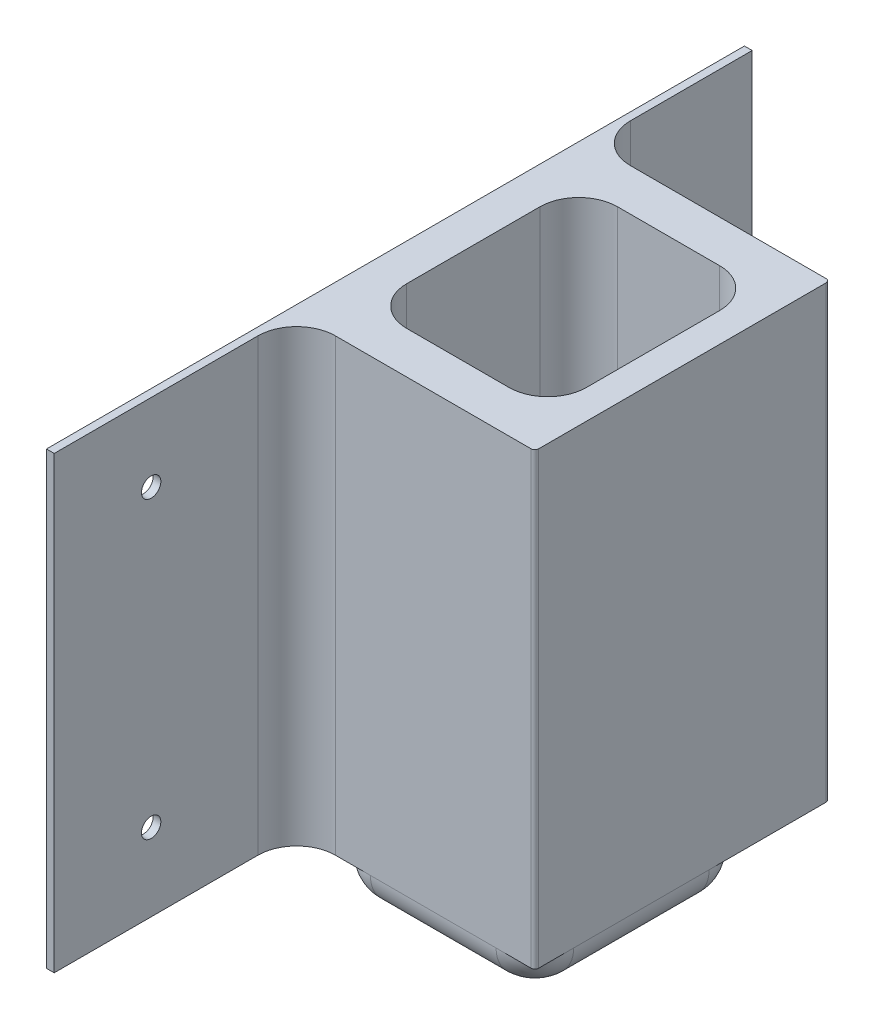
ISO-10303-21;
HEADER;
FILE_DESCRIPTION(('STEP AP214'),'2;1');
FILE_NAME('part.step','',(''),(''),'','','');
FILE_SCHEMA(('AUTOMOTIVE_DESIGN { 1 0 10303 214 1 1 1 1 }'));
ENDSEC;
DATA;
#1=APPLICATION_CONTEXT('core data for automotive mechanical design processes');
#2=APPLICATION_PROTOCOL_DEFINITION('international standard','automotive_design',2000,#1);
#3=PRODUCT_CONTEXT('',#1,'mechanical');
#4=PRODUCT('Part','Part','',(#3));
#5=PRODUCT_RELATED_PRODUCT_CATEGORY('part','',(#4));
#6=PRODUCT_DEFINITION_FORMATION('','',#4);
#7=PRODUCT_DEFINITION_CONTEXT('part definition',#1,'design');
#8=PRODUCT_DEFINITION('design','',#6,#7);
#9=PRODUCT_DEFINITION_SHAPE('','',#8);
#10=(LENGTH_UNIT() NAMED_UNIT(*) SI_UNIT(.MILLI.,.METRE.));
#11=(NAMED_UNIT(*) PLANE_ANGLE_UNIT() SI_UNIT($,.RADIAN.));
#12=(NAMED_UNIT(*) SI_UNIT($,.STERADIAN.) SOLID_ANGLE_UNIT());
#13=UNCERTAINTY_MEASURE_WITH_UNIT(LENGTH_MEASURE(1.E-05),#10,'distance_accuracy_value','');
#14=(GEOMETRIC_REPRESENTATION_CONTEXT(3) GLOBAL_UNCERTAINTY_ASSIGNED_CONTEXT((#13)) GLOBAL_UNIT_ASSIGNED_CONTEXT((#10,
#11,#12)) REPRESENTATION_CONTEXT('',''));
#15=CARTESIAN_POINT('',(0.,0.,0.));
#16=DIRECTION('',(0.,0.,1.));
#17=DIRECTION('',(1.,0.,0.));
#18=AXIS2_PLACEMENT_3D('',#15,#16,#17);
#19=CARTESIAN_POINT('',(2.,0.,0.));
#20=DIRECTION('',(-1.,0.,0.));
#21=DIRECTION('',(0.,0.,1.));
#22=AXIS2_PLACEMENT_3D('',#19,#20,#21);
#23=PLANE('',#22);
#24=CARTESIAN_POINT('',(2.,-38.,65.));
#25=DIRECTION('',(1.,0.,0.));
#26=DIRECTION('',(0.,0.,-1.));
#27=AXIS2_PLACEMENT_3D('',#24,#25,#26);
#28=CIRCLE('',#27,2.5);
#29=CARTESIAN_POINT('',(2.,-38.,62.5));
#30=VERTEX_POINT('',#29);
#31=EDGE_CURVE('E906',#30,#30,#28,.T.);
#32=ORIENTED_EDGE('',*,*,#31,.F.);
#33=EDGE_LOOP('',(#32));
#34=FACE_BOUND('',#33,.T.);
#35=DIRECTION('',(0.,0.,-1.));
#36=VECTOR('',#35,1.);
#37=CARTESIAN_POINT('',(2.,-58.,90.));
#38=LINE('',#37,#36);
#39=CARTESIAN_POINT('',(2.,-58.,90.));
#40=VERTEX_POINT('',#39);
#41=CARTESIAN_POINT('',(2.,-58.,37.470907931375));
#42=VERTEX_POINT('',#41);
#43=EDGE_CURVE('E390',#40,#42,#38,.T.);
#44=ORIENTED_EDGE('',*,*,#43,.T.);
#45=DIRECTION('',(0.,1.,0.));
#46=VECTOR('',#45,1.);
#47=CARTESIAN_POINT('',(2.,0.,37.4709079313749));
#48=LINE('',#47,#46);
#49=CARTESIAN_POINT('',(2.,58.,37.470907931375));
#50=VERTEX_POINT('',#49);
#51=EDGE_CURVE('E412',#42,#50,#48,.T.);
#52=ORIENTED_EDGE('',*,*,#51,.T.);
#53=DIRECTION('',(0.,0.,1.));
#54=VECTOR('',#53,1.);
#55=CARTESIAN_POINT('',(2.,58.,90.));
#56=LINE('',#55,#54);
#57=CARTESIAN_POINT('',(2.,58.,90.));
#58=VERTEX_POINT('',#57);
#59=EDGE_CURVE('E382',#50,#58,#56,.T.);
#60=ORIENTED_EDGE('',*,*,#59,.T.);
#61=DIRECTION('',(0.,-1.,0.));
#62=VECTOR('',#61,1.);
#63=CARTESIAN_POINT('',(2.,-58.,90.));
#64=LINE('',#63,#62);
#65=EDGE_CURVE('E387',#58,#40,#64,.T.);
#66=ORIENTED_EDGE('',*,*,#65,.T.);
#67=EDGE_LOOP('',(#44,#52,#60,#66));
#68=FACE_BOUND('',#67,.T.);
#69=CARTESIAN_POINT('',(2.,38.,65.));
#70=DIRECTION('',(1.,0.,0.));
#71=DIRECTION('',(0.,0.,-1.));
#72=AXIS2_PLACEMENT_3D('',#69,#70,#71);
#73=CIRCLE('',#72,2.5);
#74=CARTESIAN_POINT('',(2.,38.,62.5));
#75=VERTEX_POINT('',#74);
#76=EDGE_CURVE('E902',#75,#75,#73,.T.);
#77=ORIENTED_EDGE('',*,*,#76,.F.);
#78=EDGE_LOOP('',(#77));
#79=FACE_BOUND('',#78,.T.);
#80=ADVANCED_FACE('F39',(#34,#68,#79),#23,.F.);
#81=CARTESIAN_POINT('',(2.,-38.,-65.));
#82=DIRECTION('',(1.,0.,0.));
#83=DIRECTION('',(0.,0.,-1.));
#84=AXIS2_PLACEMENT_3D('',#81,#82,#83);
#85=CIRCLE('',#84,2.5);
#86=CARTESIAN_POINT('',(2.,-38.,-67.5));
#87=VERTEX_POINT('',#86);
#88=EDGE_CURVE('E915',#87,#87,#85,.T.);
#89=ORIENTED_EDGE('',*,*,#88,.F.);
#90=EDGE_LOOP('',(#89));
#91=FACE_BOUND('',#90,.T.);
#92=CARTESIAN_POINT('',(2.,58.,-90.));
#93=VERTEX_POINT('',#92);
#94=CARTESIAN_POINT('',(2.,58.,-58.586349214035));
#95=VERTEX_POINT('',#94);
#96=EDGE_CURVE('E384',#93,#95,#56,.T.);
#97=ORIENTED_EDGE('',*,*,#96,.T.);
#98=DIRECTION('',(0.,1.,0.));
#99=VECTOR('',#98,1.);
#100=CARTESIAN_POINT('',(2.,-58.,-58.5863492140351));
#101=LINE('',#100,#99);
#102=CARTESIAN_POINT('',(2.,-58.,-58.586349214035));
#103=VERTEX_POINT('',#102);
#104=EDGE_CURVE('E420',#95,#103,#101,.F.);
#105=ORIENTED_EDGE('',*,*,#104,.T.);
#106=CARTESIAN_POINT('',(2.,-58.,-90.));
#107=VERTEX_POINT('',#106);
#108=EDGE_CURVE('E389',#103,#107,#38,.T.);
#109=ORIENTED_EDGE('',*,*,#108,.T.);
#110=DIRECTION('',(0.,1.,0.));
#111=VECTOR('',#110,1.);
#112=CARTESIAN_POINT('',(2.,-58.,-90.));
#113=LINE('',#112,#111);
#114=EDGE_CURVE('E379',#107,#93,#113,.T.);
#115=ORIENTED_EDGE('',*,*,#114,.T.);
#116=EDGE_LOOP('',(#97,#105,#109,#115));
#117=FACE_BOUND('',#116,.T.);
#118=CARTESIAN_POINT('',(2.,38.,-65.));
#119=DIRECTION('',(1.,0.,0.));
#120=DIRECTION('',(0.,0.,-1.));
#121=AXIS2_PLACEMENT_3D('',#118,#119,#120);
#122=CIRCLE('',#121,2.5);
#123=CARTESIAN_POINT('',(2.,38.,-67.5));
#124=VERTEX_POINT('',#123);
#125=EDGE_CURVE('E921',#124,#124,#122,.T.);
#126=ORIENTED_EDGE('',*,*,#125,.F.);
#127=EDGE_LOOP('',(#126));
#128=FACE_BOUND('',#127,.T.);
#129=ADVANCED_FACE('F541',(#91,#117,#128),#23,.F.);
#130=CARTESIAN_POINT('',(2.,-58.,90.));
#131=DIRECTION('',(0.,1.,0.));
#132=DIRECTION('',(0.,0.,1.));
#133=AXIS2_PLACEMENT_3D('',#130,#131,#132);
#134=PLANE('',#133);
#135=CARTESIAN_POINT('',(53.4290934014321,-58.,-17.4709079313749));
#136=DIRECTION('',(0.,-1.,0.));
#137=DIRECTION('',(0.,0.,-1.));
#138=AXIS2_PLACEMENT_3D('',#135,#136,#137);
#139=CIRCLE('',#138,10.);
#140=CARTESIAN_POINT('',(55.894546700716,-58.,-27.1622205374696));
#141=VERTEX_POINT('',#140);
#142=CARTESIAN_POINT('',(63.4290934014321,-58.,-17.4709079313749));
#143=VERTEX_POINT('',#142);
#144=EDGE_CURVE('E273',#141,#143,#139,.T.);
#145=ORIENTED_EDGE('',*,*,#144,.F.);
#146=DIRECTION('',(0.,0.,1.));
#147=VECTOR('',#146,1.);
#148=CARTESIAN_POINT('',(55.894546700716,-58.,0.));
#149=LINE('',#148,#147);
#150=CARTESIAN_POINT('',(55.894546700716,-58.,-27.7377206413301));
#151=VERTEX_POINT('',#150);
#152=EDGE_CURVE('E341',#151,#141,#149,.T.);
#153=ORIENTED_EDGE('',*,*,#152,.F.);
#154=CARTESIAN_POINT('',(45.894546700716,-58.,-27.7377206413301));
#155=DIRECTION('',(0.,1.,0.));
#156=DIRECTION('',(0.,0.,1.));
#157=AXIS2_PLACEMENT_3D('',#154,#155,#156);
#158=CIRCLE('',#157,9.99999999999999);
#159=CARTESIAN_POINT('',(45.894546700716,-58.,-37.7377206413301));
#160=VERTEX_POINT('',#159);
#161=EDGE_CURVE('E372',#151,#160,#158,.T.);
#162=ORIENTED_EDGE('',*,*,#161,.T.);
#163=DIRECTION('',(-1.,0.,0.));
#164=VECTOR('',#163,1.);
#165=CARTESIAN_POINT('',(0.,-58.,-37.7377206413301));
#166=LINE('',#165,#164);
#167=CARTESIAN_POINT('',(19.5345467007161,-58.,-37.7377206413301));
#168=VERTEX_POINT('',#167);
#169=EDGE_CURVE('E328',#160,#168,#166,.T.);
#170=ORIENTED_EDGE('',*,*,#169,.T.);
#171=CARTESIAN_POINT('',(19.5345467007161,-58.,-27.7377206413301));
#172=DIRECTION('',(0.,1.,0.));
#173=DIRECTION('',(0.,0.,1.));
#174=AXIS2_PLACEMENT_3D('',#171,#172,#173);
#175=CIRCLE('',#174,10.);
#176=CARTESIAN_POINT('',(9.53454670071606,-58.,-27.7377206413301));
#177=VERTEX_POINT('',#176);
#178=EDGE_CURVE('E325',#168,#177,#175,.T.);
#179=ORIENTED_EDGE('',*,*,#178,.T.);
#180=DIRECTION('',(0.,0.,1.));
#181=VECTOR('',#180,1.);
#182=CARTESIAN_POINT('',(9.53454670071606,-58.,0.));
#183=LINE('',#182,#181);
#184=CARTESIAN_POINT('',(9.53454670071606,-58.,6.62227935866991));
#185=VERTEX_POINT('',#184);
#186=EDGE_CURVE('E348',#177,#185,#183,.T.);
#187=ORIENTED_EDGE('',*,*,#186,.T.);
#188=CARTESIAN_POINT('',(19.5345467007161,-58.,6.62227935866991));
#189=DIRECTION('',(0.,1.,0.));
#190=DIRECTION('',(0.,0.,1.));
#191=AXIS2_PLACEMENT_3D('',#188,#189,#190);
#192=CIRCLE('',#191,10.);
#193=CARTESIAN_POINT('',(11.0229000270385,-58.,11.8712669660541));
#194=VERTEX_POINT('',#193);
#195=EDGE_CURVE('E369',#185,#194,#192,.T.);
#196=ORIENTED_EDGE('',*,*,#195,.T.);
#197=DIRECTION('',(0.,0.,-1.));
#198=VECTOR('',#197,1.);
#199=CARTESIAN_POINT('',(11.0229000270385,-58.,-17.4709079313749));
#200=LINE('',#199,#198);
#201=CARTESIAN_POINT('',(11.0229000270385,-58.,17.4709079313749));
#202=VERTEX_POINT('',#201);
#203=EDGE_CURVE('E276',#202,#194,#200,.T.);
#204=ORIENTED_EDGE('',*,*,#203,.F.);
#205=CARTESIAN_POINT('',(21.0229000270385,-58.,17.4709079313749));
#206=DIRECTION('',(0.,-1.,0.));
#207=DIRECTION('',(0.,0.,1.));
#208=AXIS2_PLACEMENT_3D('',#205,#206,#207);
#209=CIRCLE('',#208,10.);
#210=CARTESIAN_POINT('',(21.0229000270385,-58.,27.4709079313749));
#211=VERTEX_POINT('',#210);
#212=EDGE_CURVE('E266',#211,#202,#209,.T.);
#213=ORIENTED_EDGE('',*,*,#212,.F.);
#214=DIRECTION('',(-1.,0.,0.));
#215=VECTOR('',#214,1.);
#216=CARTESIAN_POINT('',(0.,-58.,27.4709079313749));
#217=LINE('',#216,#215);
#218=CARTESIAN_POINT('',(12.,-58.,27.4709079313749));
#219=VERTEX_POINT('',#218);
#220=EDGE_CURVE('E236',#211,#219,#217,.T.);
#221=ORIENTED_EDGE('',*,*,#220,.T.);
#222=CARTESIAN_POINT('',(12.,-58.,37.4709079313749));
#223=DIRECTION('',(0.,1.,0.));
#224=DIRECTION('',(0.,0.,1.));
#225=AXIS2_PLACEMENT_3D('',#222,#223,#224);
#226=CIRCLE('',#225,10.);
#227=EDGE_CURVE('E424',#219,#42,#226,.T.);
#228=ORIENTED_EDGE('',*,*,#227,.T.);
#229=ORIENTED_EDGE('',*,*,#43,.F.);
#230=DIRECTION('',(-1.,0.,0.));
#231=VECTOR('',#230,1.);
#232=CARTESIAN_POINT('',(2.,-58.,90.));
#233=LINE('',#232,#231);
#234=CARTESIAN_POINT('',(0.,-58.,90.));
#235=VERTEX_POINT('',#234);
#236=EDGE_CURVE('E403',#40,#235,#233,.T.);
#237=ORIENTED_EDGE('',*,*,#236,.T.);
#238=DIRECTION('',(0.,0.,-1.));
#239=VECTOR('',#238,1.);
#240=CARTESIAN_POINT('',(0.,-58.,90.));
#241=LINE('',#240,#239);
#242=CARTESIAN_POINT('',(0.,-58.,-90.));
#243=VERTEX_POINT('',#242);
#244=EDGE_CURVE('E383',#235,#243,#241,.T.);
#245=ORIENTED_EDGE('',*,*,#244,.T.);
#246=DIRECTION('',(-1.,0.,0.));
#247=VECTOR('',#246,1.);
#248=CARTESIAN_POINT('',(2.,-58.,-90.));
#249=LINE('',#248,#247);
#250=EDGE_CURVE('E393',#107,#243,#249,.T.);
#251=ORIENTED_EDGE('',*,*,#250,.F.);
#252=ORIENTED_EDGE('',*,*,#108,.F.);
#253=CARTESIAN_POINT('',(12.,-58.,-58.5863492140351));
#254=DIRECTION('',(0.,1.,0.));
#255=DIRECTION('',(0.,0.,1.));
#256=AXIS2_PLACEMENT_3D('',#253,#254,#255);
#257=CIRCLE('',#256,10.);
#258=CARTESIAN_POINT('',(12.,-58.,-48.5863492140351));
#259=VERTEX_POINT('',#258);
#260=EDGE_CURVE('E428',#103,#259,#257,.T.);
#261=ORIENTED_EDGE('',*,*,#260,.T.);
#262=DIRECTION('',(-1.,0.,0.));
#263=VECTOR('',#262,1.);
#264=CARTESIAN_POINT('',(0.,-58.,-48.5863492140351));
#265=LINE('',#264,#263);
#266=CARTESIAN_POINT('',(62.4519934284706,-58.,-48.5863492140351));
#267=VERTEX_POINT('',#266);
#268=EDGE_CURVE('E349',#267,#259,#265,.T.);
#269=ORIENTED_EDGE('',*,*,#268,.F.);
#270=CARTESIAN_POINT('',(62.4519934284706,-58.,-47.6092492410736));
#271=DIRECTION('',(0.,1.,0.));
#272=DIRECTION('',(0.,0.,1.));
#273=AXIS2_PLACEMENT_3D('',#270,#271,#272);
#274=CIRCLE('',#273,0.977099972961519);
#275=CARTESIAN_POINT('',(63.4290934014321,-58.,-47.6092492410736));
#276=VERTEX_POINT('',#275);
#277=EDGE_CURVE('E345',#276,#267,#274,.T.);
#278=ORIENTED_EDGE('',*,*,#277,.F.);
#279=DIRECTION('',(0.,0.,1.));
#280=VECTOR('',#279,1.);
#281=CARTESIAN_POINT('',(63.4290934014321,-58.,0.));
#282=LINE('',#281,#280);
#283=EDGE_CURVE('E361',#276,#143,#282,.T.);
#284=ORIENTED_EDGE('',*,*,#283,.T.);
#285=EDGE_LOOP('',(#145,#153,#162,#170,#179,#187,#196,#204,#213,#221,#228,#229,#237,#245,#251,
#252,#261,#269,#278,#284));
#286=FACE_BOUND('',#285,.T.);
#287=ADVANCED_FACE('F466',(#286),#134,.F.);
#288=CARTESIAN_POINT('',(2.,-58.,-90.));
#289=DIRECTION('',(0.,0.,1.));
#290=DIRECTION('',(1.,0.,0.));
#291=AXIS2_PLACEMENT_3D('',#288,#289,#290);
#292=PLANE('',#291);
#293=DIRECTION('',(0.,1.,0.));
#294=VECTOR('',#293,1.);
#295=CARTESIAN_POINT('',(0.,-58.,-90.));
#296=LINE('',#295,#294);
#297=CARTESIAN_POINT('',(0.,58.,-90.));
#298=VERTEX_POINT('',#297);
#299=EDGE_CURVE('E249',#243,#298,#296,.T.);
#300=ORIENTED_EDGE('',*,*,#299,.T.);
#301=DIRECTION('',(-1.,0.,0.));
#302=VECTOR('',#301,1.);
#303=CARTESIAN_POINT('',(2.,58.,-90.));
#304=LINE('',#303,#302);
#305=EDGE_CURVE('E409',#93,#298,#304,.T.);
#306=ORIENTED_EDGE('',*,*,#305,.F.);
#307=ORIENTED_EDGE('',*,*,#114,.F.);
#308=ORIENTED_EDGE('',*,*,#250,.T.);
#309=EDGE_LOOP('',(#300,#306,#307,#308));
#310=FACE_BOUND('',#309,.T.);
#311=ADVANCED_FACE('F565',(#310),#292,.F.);
#312=CARTESIAN_POINT('',(2.,58.,90.));
#313=DIRECTION('',(0.,-1.,0.));
#314=DIRECTION('',(0.,0.,-1.));
#315=AXIS2_PLACEMENT_3D('',#312,#313,#314);
#316=PLANE('',#315);
#317=DIRECTION('',(0.,0.,1.));
#318=VECTOR('',#317,1.);
#319=CARTESIAN_POINT('',(0.,58.,90.));
#320=LINE('',#319,#318);
#321=CARTESIAN_POINT('',(0.,58.,90.));
#322=VERTEX_POINT('',#321);
#323=EDGE_CURVE('E396',#298,#322,#320,.T.);
#324=ORIENTED_EDGE('',*,*,#323,.T.);
#325=DIRECTION('',(-1.,0.,0.));
#326=VECTOR('',#325,1.);
#327=CARTESIAN_POINT('',(2.,58.,90.));
#328=LINE('',#327,#326);
#329=EDGE_CURVE('E406',#58,#322,#328,.T.);
#330=ORIENTED_EDGE('',*,*,#329,.F.);
#331=ORIENTED_EDGE('',*,*,#59,.F.);
#332=CARTESIAN_POINT('',(12.,58.,37.4709079313749));
#333=DIRECTION('',(0.,-1.,0.));
#334=DIRECTION('',(0.,0.,-1.));
#335=AXIS2_PLACEMENT_3D('',#332,#333,#334);
#336=CIRCLE('',#335,10.);
#337=CARTESIAN_POINT('',(12.,58.,27.4709079313749));
#338=VERTEX_POINT('',#337);
#339=EDGE_CURVE('E422',#50,#338,#336,.T.);
#340=ORIENTED_EDGE('',*,*,#339,.T.);
#341=DIRECTION('',(-1.,0.,0.));
#342=VECTOR('',#341,1.);
#343=CARTESIAN_POINT('',(0.,58.,27.4709079313749));
#344=LINE('',#343,#342);
#345=CARTESIAN_POINT('',(62.4519934284706,58.,27.4709079313749));
#346=VERTEX_POINT('',#345);
#347=EDGE_CURVE('E313',#346,#338,#344,.T.);
#348=ORIENTED_EDGE('',*,*,#347,.F.);
#349=CARTESIAN_POINT('',(62.4519934284706,58.,26.4938079584134));
#350=DIRECTION('',(0.,-1.,0.));
#351=DIRECTION('',(0.,0.,-1.));
#352=AXIS2_PLACEMENT_3D('',#349,#350,#351);
#353=CIRCLE('',#352,0.977099972961512);
#354=CARTESIAN_POINT('',(63.4290934014321,58.,26.4938079584134));
#355=VERTEX_POINT('',#354);
#356=EDGE_CURVE('E308',#355,#346,#353,.T.);
#357=ORIENTED_EDGE('',*,*,#356,.F.);
#358=DIRECTION('',(0.,0.,1.));
#359=VECTOR('',#358,1.);
#360=CARTESIAN_POINT('',(63.4290934014321,58.,0.));
#361=LINE('',#360,#359);
#362=CARTESIAN_POINT('',(63.4290934014321,58.,-47.6092492410736));
#363=VERTEX_POINT('',#362);
#364=EDGE_CURVE('E290',#363,#355,#361,.T.);
#365=ORIENTED_EDGE('',*,*,#364,.F.);
#366=CARTESIAN_POINT('',(62.4519934284706,58.,-47.6092492410736));
#367=DIRECTION('',(0.,-1.,0.));
#368=DIRECTION('',(0.,0.,-1.));
#369=AXIS2_PLACEMENT_3D('',#366,#367,#368);
#370=CIRCLE('',#369,0.977099972961519);
#371=CARTESIAN_POINT('',(62.4519934284706,58.,-48.5863492140351));
#372=VERTEX_POINT('',#371);
#373=EDGE_CURVE('E319',#363,#372,#370,.F.);
#374=ORIENTED_EDGE('',*,*,#373,.T.);
#375=DIRECTION('',(-1.,0.,0.));
#376=VECTOR('',#375,1.);
#377=CARTESIAN_POINT('',(0.,58.,-48.5863492140351));
#378=LINE('',#377,#376);
#379=CARTESIAN_POINT('',(12.,58.,-48.5863492140351));
#380=VERTEX_POINT('',#379);
#381=EDGE_CURVE('E316',#372,#380,#378,.T.);
#382=ORIENTED_EDGE('',*,*,#381,.T.);
#383=CARTESIAN_POINT('',(12.,58.,-58.5863492140351));
#384=DIRECTION('',(0.,-1.,0.));
#385=DIRECTION('',(0.,0.,-1.));
#386=AXIS2_PLACEMENT_3D('',#383,#384,#385);
#387=CIRCLE('',#386,10.);
#388=EDGE_CURVE('E426',#380,#95,#387,.T.);
#389=ORIENTED_EDGE('',*,*,#388,.T.);
#390=ORIENTED_EDGE('',*,*,#96,.F.);
#391=ORIENTED_EDGE('',*,*,#305,.T.);
#392=EDGE_LOOP('',(#324,#330,#331,#340,#348,#357,#365,#374,#382,#389,#390,#391));
#393=FACE_BOUND('',#392,.T.);
#394=CARTESIAN_POINT('',(19.5345467007161,58.,-27.7377206413301));
#395=DIRECTION('',(0.,-1.,0.));
#396=DIRECTION('',(0.,0.,-1.));
#397=AXIS2_PLACEMENT_3D('',#394,#395,#396);
#398=CIRCLE('',#397,10.);
#399=CARTESIAN_POINT('',(19.5345467007161,58.,-37.7377206413301));
#400=VERTEX_POINT('',#399);
#401=CARTESIAN_POINT('',(9.53454670071606,58.,-27.7377206413301));
#402=VERTEX_POINT('',#401);
#403=EDGE_CURVE('E302',#400,#402,#398,.F.);
#404=ORIENTED_EDGE('',*,*,#403,.F.);
#405=DIRECTION('',(-1.,0.,0.));
#406=VECTOR('',#405,1.);
#407=CARTESIAN_POINT('',(0.,58.,-37.7377206413301));
#408=LINE('',#407,#406);
#409=CARTESIAN_POINT('',(45.894546700716,58.,-37.7377206413301));
#410=VERTEX_POINT('',#409);
#411=EDGE_CURVE('E299',#410,#400,#408,.T.);
#412=ORIENTED_EDGE('',*,*,#411,.F.);
#413=CARTESIAN_POINT('',(45.894546700716,58.,-27.7377206413301));
#414=DIRECTION('',(0.,-1.,0.));
#415=DIRECTION('',(0.,0.,-1.));
#416=AXIS2_PLACEMENT_3D('',#413,#414,#415);
#417=CIRCLE('',#416,9.99999999999999);
#418=CARTESIAN_POINT('',(55.894546700716,58.,-27.7377206413301));
#419=VERTEX_POINT('',#418);
#420=EDGE_CURVE('E296',#419,#410,#417,.F.);
#421=ORIENTED_EDGE('',*,*,#420,.F.);
#422=DIRECTION('',(0.,0.,1.));
#423=VECTOR('',#422,1.);
#424=CARTESIAN_POINT('',(55.894546700716,58.,0.));
#425=LINE('',#424,#423);
#426=CARTESIAN_POINT('',(55.894546700716,58.,6.62227935866991));
#427=VERTEX_POINT('',#426);
#428=EDGE_CURVE('E293',#419,#427,#425,.T.);
#429=ORIENTED_EDGE('',*,*,#428,.T.);
#430=CARTESIAN_POINT('',(45.894546700716,58.,6.62227935866991));
#431=DIRECTION('',(0.,-1.,0.));
#432=DIRECTION('',(0.,0.,-1.));
#433=AXIS2_PLACEMENT_3D('',#430,#431,#432);
#434=CIRCLE('',#433,10.);
#435=CARTESIAN_POINT('',(45.894546700716,58.,16.6222793586699));
#436=VERTEX_POINT('',#435);
#437=EDGE_CURVE('E289',#427,#436,#434,.T.);
#438=ORIENTED_EDGE('',*,*,#437,.T.);
#439=DIRECTION('',(-1.,0.,0.));
#440=VECTOR('',#439,1.);
#441=CARTESIAN_POINT('',(0.,58.,16.6222793586699));
#442=LINE('',#441,#440);
#443=CARTESIAN_POINT('',(19.5345467007161,58.,16.6222793586699));
#444=VERTEX_POINT('',#443);
#445=EDGE_CURVE('E286',#436,#444,#442,.T.);
#446=ORIENTED_EDGE('',*,*,#445,.T.);
#447=CARTESIAN_POINT('',(19.5345467007161,58.,6.62227935866991));
#448=DIRECTION('',(0.,-1.,0.));
#449=DIRECTION('',(0.,0.,-1.));
#450=AXIS2_PLACEMENT_3D('',#447,#448,#449);
#451=CIRCLE('',#450,10.);
#452=CARTESIAN_POINT('',(9.53454670071606,58.,6.62227935866991));
#453=VERTEX_POINT('',#452);
#454=EDGE_CURVE('E285',#453,#444,#451,.F.);
#455=ORIENTED_EDGE('',*,*,#454,.F.);
#456=DIRECTION('',(0.,0.,1.));
#457=VECTOR('',#456,1.);
#458=CARTESIAN_POINT('',(9.53454670071606,58.,0.));
#459=LINE('',#458,#457);
#460=EDGE_CURVE('E305',#402,#453,#459,.T.);
#461=ORIENTED_EDGE('',*,*,#460,.F.);
#462=EDGE_LOOP('',(#404,#412,#421,#429,#438,#446,#455,#461));
#463=FACE_BOUND('',#462,.T.);
#464=ADVANCED_FACE('F508',(#393,#463),#316,.F.);
#465=CARTESIAN_POINT('',(2.,-58.,90.));
#466=DIRECTION('',(0.,0.,-1.));
#467=DIRECTION('',(-1.,0.,0.));
#468=AXIS2_PLACEMENT_3D('',#465,#466,#467);
#469=PLANE('',#468);
#470=DIRECTION('',(0.,-1.,0.));
#471=VECTOR('',#470,1.);
#472=CARTESIAN_POINT('',(0.,-58.,90.));
#473=LINE('',#472,#471);
#474=EDGE_CURVE('E398',#322,#235,#473,.T.);
#475=ORIENTED_EDGE('',*,*,#474,.T.);
#476=ORIENTED_EDGE('',*,*,#236,.F.);
#477=ORIENTED_EDGE('',*,*,#65,.F.);
#478=ORIENTED_EDGE('',*,*,#329,.T.);
#479=EDGE_LOOP('',(#475,#476,#477,#478));
#480=FACE_BOUND('',#479,.T.);
#481=ADVANCED_FACE('F559',(#480),#469,.F.);
#482=CARTESIAN_POINT('',(53.4290934014321,-58.,17.4709079313749));
#483=DIRECTION('',(0.,-1.,0.));
#484=DIRECTION('',(0.,0.,1.));
#485=AXIS2_PLACEMENT_3D('',#482,#483,#484);
#486=CIRCLE('',#485,10.);
#487=CARTESIAN_POINT('',(63.4290934014321,-58.,17.4709079313749));
#488=VERTEX_POINT('',#487);
#489=CARTESIAN_POINT('',(53.4290934014321,-58.,27.4709079313749));
#490=VERTEX_POINT('',#489);
#491=EDGE_CURVE('E244',#488,#490,#486,.T.);
#492=ORIENTED_EDGE('',*,*,#491,.F.);
#493=CARTESIAN_POINT('',(63.4290934014321,-58.,26.4938079584134));
#494=VERTEX_POINT('',#493);
#495=EDGE_CURVE('E327',#488,#494,#282,.T.);
#496=ORIENTED_EDGE('',*,*,#495,.T.);
#497=CARTESIAN_POINT('',(62.4519934284706,-58.,26.4938079584134));
#498=DIRECTION('',(0.,1.,0.));
#499=DIRECTION('',(0.,0.,1.));
#500=AXIS2_PLACEMENT_3D('',#497,#498,#499);
#501=CIRCLE('',#500,0.977099972961512);
#502=CARTESIAN_POINT('',(62.4519934284706,-58.,27.4709079313749));
#503=VERTEX_POINT('',#502);
#504=EDGE_CURVE('E247',#494,#503,#501,.F.);
#505=ORIENTED_EDGE('',*,*,#504,.T.);
#506=EDGE_CURVE('E234',#503,#490,#217,.T.);
#507=ORIENTED_EDGE('',*,*,#506,.T.);
#508=EDGE_LOOP('',(#492,#496,#505,#507));
#509=FACE_BOUND('',#508,.T.);
#510=ADVANCED_FACE('F242',(#509),#134,.F.);
#511=CARTESIAN_POINT('',(0.,0.,0.));
#512=DIRECTION('',(-1.,0.,0.));
#513=DIRECTION('',(0.,0.,1.));
#514=AXIS2_PLACEMENT_3D('',#511,#512,#513);
#515=PLANE('',#514);
#516=CARTESIAN_POINT('',(0.,38.,65.));
#517=DIRECTION('',(-1.,0.,0.));
#518=DIRECTION('',(0.,0.,1.));
#519=AXIS2_PLACEMENT_3D('',#516,#517,#518);
#520=CIRCLE('',#519,2.5);
#521=CARTESIAN_POINT('',(0.,38.,67.5));
#522=VERTEX_POINT('',#521);
#523=EDGE_CURVE('E905',#522,#522,#520,.T.);
#524=ORIENTED_EDGE('',*,*,#523,.F.);
#525=EDGE_LOOP('',(#524));
#526=FACE_BOUND('',#525,.T.);
#527=CARTESIAN_POINT('',(0.,-38.,65.));
#528=DIRECTION('',(-1.,0.,0.));
#529=DIRECTION('',(0.,0.,1.));
#530=AXIS2_PLACEMENT_3D('',#527,#528,#529);
#531=CIRCLE('',#530,2.5);
#532=CARTESIAN_POINT('',(0.,-38.,67.5));
#533=VERTEX_POINT('',#532);
#534=EDGE_CURVE('E909',#533,#533,#531,.T.);
#535=ORIENTED_EDGE('',*,*,#534,.F.);
#536=EDGE_LOOP('',(#535));
#537=FACE_BOUND('',#536,.T.);
#538=CARTESIAN_POINT('',(0.,-38.,-65.));
#539=DIRECTION('',(-1.,0.,0.));
#540=DIRECTION('',(0.,0.,1.));
#541=AXIS2_PLACEMENT_3D('',#538,#539,#540);
#542=CIRCLE('',#541,2.5);
#543=CARTESIAN_POINT('',(0.,-38.,-62.5));
#544=VERTEX_POINT('',#543);
#545=EDGE_CURVE('E918',#544,#544,#542,.T.);
#546=ORIENTED_EDGE('',*,*,#545,.F.);
#547=EDGE_LOOP('',(#546));
#548=FACE_BOUND('',#547,.T.);
#549=CARTESIAN_POINT('',(0.,38.,-65.));
#550=DIRECTION('',(-1.,0.,0.));
#551=DIRECTION('',(0.,0.,1.));
#552=AXIS2_PLACEMENT_3D('',#549,#550,#551);
#553=CIRCLE('',#552,2.5);
#554=CARTESIAN_POINT('',(0.,38.,-62.5));
#555=VERTEX_POINT('',#554);
#556=EDGE_CURVE('E447',#555,#555,#553,.T.);
#557=ORIENTED_EDGE('',*,*,#556,.F.);
#558=EDGE_LOOP('',(#557));
#559=FACE_BOUND('',#558,.T.);
#560=ORIENTED_EDGE('',*,*,#299,.F.);
#561=ORIENTED_EDGE('',*,*,#244,.F.);
#562=ORIENTED_EDGE('',*,*,#474,.F.);
#563=ORIENTED_EDGE('',*,*,#323,.F.);
#564=EDGE_LOOP('',(#560,#561,#562,#563));
#565=FACE_BOUND('',#564,.T.);
#566=ADVANCED_FACE('F553',(#526,#537,#548,#559,#565),#515,.T.);
#567=CARTESIAN_POINT('',(9.53454670071606,-155.766251235306,0.));
#568=DIRECTION('',(1.,0.,0.));
#569=DIRECTION('',(0.,0.,-1.));
#570=AXIS2_PLACEMENT_3D('',#567,#568,#569);
#571=PLANE('',#570);
#572=ORIENTED_EDGE('',*,*,#186,.F.);
#573=DIRECTION('',(0.,1.,0.));
#574=VECTOR('',#573,1.);
#575=CARTESIAN_POINT('',(9.53454670071606,-155.766251235306,-27.7377206413301));
#576=LINE('',#575,#574);
#577=EDGE_CURVE('E322',#177,#402,#576,.T.);
#578=ORIENTED_EDGE('',*,*,#577,.T.);
#579=ORIENTED_EDGE('',*,*,#460,.T.);
#580=DIRECTION('',(0.,1.,0.));
#581=VECTOR('',#580,1.);
#582=CARTESIAN_POINT('',(9.53454670071606,-155.766251235306,6.62227935866991));
#583=LINE('',#582,#581);
#584=EDGE_CURVE('E329',#185,#453,#583,.T.);
#585=ORIENTED_EDGE('',*,*,#584,.F.);
#586=EDGE_LOOP('',(#572,#578,#579,#585));
#587=FACE_BOUND('',#586,.T.);
#588=ADVANCED_FACE('F517',(#587),#571,.T.);
#589=CARTESIAN_POINT('',(19.5345467007161,-155.766251235306,6.62227935866991));
#590=DIRECTION('',(0.,1.,0.));
#591=DIRECTION('',(0.,0.,1.));
#592=AXIS2_PLACEMENT_3D('',#589,#590,#591);
#593=CYLINDRICAL_SURFACE('',#592,10.);
#594=ORIENTED_EDGE('',*,*,#195,.F.);
#595=ORIENTED_EDGE('',*,*,#584,.T.);
#596=ORIENTED_EDGE('',*,*,#454,.T.);
#597=DIRECTION('',(0.,1.,0.));
#598=VECTOR('',#597,1.);
#599=CARTESIAN_POINT('',(19.5345467007161,-155.766251235306,16.6222793586699));
#600=LINE('',#599,#598);
#601=CARTESIAN_POINT('',(19.5345467007161,-58.,16.6222793586699));
#602=VERTEX_POINT('',#601);
#603=EDGE_CURVE('E332',#602,#444,#600,.T.);
#604=ORIENTED_EDGE('',*,*,#603,.F.);
#605=EDGE_CURVE('E368',#194,#602,#192,.T.);
#606=ORIENTED_EDGE('',*,*,#605,.F.);
#607=EDGE_LOOP('',(#594,#595,#596,#604,#606));
#608=FACE_BOUND('',#607,.T.);
#609=ADVANCED_FACE('F514',(#608),#593,.F.);
#610=CARTESIAN_POINT('',(0.,-155.766251235306,16.6222793586699));
#611=DIRECTION('',(0.,0.,1.));
#612=DIRECTION('',(1.,0.,0.));
#613=AXIS2_PLACEMENT_3D('',#610,#611,#612);
#614=PLANE('',#613);
#615=DIRECTION('',(0.,1.,0.));
#616=VECTOR('',#615,1.);
#617=CARTESIAN_POINT('',(45.894546700716,-155.766251235306,16.6222793586699));
#618=LINE('',#617,#616);
#619=CARTESIAN_POINT('',(45.894546700716,-58.,16.6222793586699));
#620=VERTEX_POINT('',#619);
#621=EDGE_CURVE('E335',#620,#436,#618,.T.);
#622=ORIENTED_EDGE('',*,*,#621,.F.);
#623=DIRECTION('',(-1.,0.,0.));
#624=VECTOR('',#623,1.);
#625=CARTESIAN_POINT('',(0.,-58.,16.6222793586699));
#626=LINE('',#625,#624);
#627=EDGE_CURVE('E331',#620,#602,#626,.T.);
#628=ORIENTED_EDGE('',*,*,#627,.T.);
#629=ORIENTED_EDGE('',*,*,#603,.T.);
#630=ORIENTED_EDGE('',*,*,#445,.F.);
#631=EDGE_LOOP('',(#622,#628,#629,#630));
#632=FACE_BOUND('',#631,.T.);
#633=ADVANCED_FACE('F512',(#632),#614,.F.);
#634=CARTESIAN_POINT('',(45.894546700716,-155.766251235306,6.62227935866991));
#635=DIRECTION('',(0.,1.,0.));
#636=DIRECTION('',(0.,0.,1.));
#637=AXIS2_PLACEMENT_3D('',#634,#635,#636);
#638=CYLINDRICAL_SURFACE('',#637,10.);
#639=DIRECTION('',(0.,1.,0.));
#640=VECTOR('',#639,1.);
#641=CARTESIAN_POINT('',(55.894546700716,-155.766251235306,6.62227935866991));
#642=LINE('',#641,#640);
#643=CARTESIAN_POINT('',(55.894546700716,-58.,6.62227935866991));
#644=VERTEX_POINT('',#643);
#645=EDGE_CURVE('E338',#644,#427,#642,.T.);
#646=ORIENTED_EDGE('',*,*,#645,.F.);
#647=CARTESIAN_POINT('',(45.894546700716,-58.,6.62227935866991));
#648=DIRECTION('',(0.,1.,0.));
#649=DIRECTION('',(0.,0.,1.));
#650=AXIS2_PLACEMENT_3D('',#647,#648,#649);
#651=CIRCLE('',#650,10.);
#652=EDGE_CURVE('E334',#644,#620,#651,.F.);
#653=ORIENTED_EDGE('',*,*,#652,.T.);
#654=ORIENTED_EDGE('',*,*,#621,.T.);
#655=ORIENTED_EDGE('',*,*,#437,.F.);
#656=EDGE_LOOP('',(#646,#653,#654,#655));
#657=FACE_BOUND('',#656,.T.);
#658=ADVANCED_FACE('F503',(#657),#638,.F.);
#659=CARTESIAN_POINT('',(55.894546700716,-155.766251235306,0.));
#660=DIRECTION('',(1.,0.,0.));
#661=DIRECTION('',(0.,0.,-1.));
#662=AXIS2_PLACEMENT_3D('',#659,#660,#661);
#663=PLANE('',#662);
#664=DIRECTION('',(0.,1.,0.));
#665=VECTOR('',#664,1.);
#666=CARTESIAN_POINT('',(55.894546700716,-155.766251235306,-27.7377206413301));
#667=LINE('',#666,#665);
#668=EDGE_CURVE('E340',#151,#419,#667,.T.);
#669=ORIENTED_EDGE('',*,*,#668,.F.);
#670=ORIENTED_EDGE('',*,*,#152,.T.);
#671=EDGE_CURVE('E337',#141,#644,#149,.T.);
#672=ORIENTED_EDGE('',*,*,#671,.T.);
#673=ORIENTED_EDGE('',*,*,#645,.T.);
#674=ORIENTED_EDGE('',*,*,#428,.F.);
#675=EDGE_LOOP('',(#669,#670,#672,#673,#674));
#676=FACE_BOUND('',#675,.T.);
#677=ADVANCED_FACE('F499',(#676),#663,.F.);
#678=CARTESIAN_POINT('',(45.894546700716,-155.766251235306,-27.7377206413301));
#679=DIRECTION('',(0.,1.,0.));
#680=DIRECTION('',(0.,0.,1.));
#681=AXIS2_PLACEMENT_3D('',#678,#679,#680);
#682=CYLINDRICAL_SURFACE('',#681,9.99999999999999);
#683=ORIENTED_EDGE('',*,*,#161,.F.);
#684=ORIENTED_EDGE('',*,*,#668,.T.);
#685=ORIENTED_EDGE('',*,*,#420,.T.);
#686=DIRECTION('',(0.,1.,0.));
#687=VECTOR('',#686,1.);
#688=CARTESIAN_POINT('',(45.894546700716,-155.766251235306,-37.7377206413301));
#689=LINE('',#688,#687);
#690=EDGE_CURVE('E343',#160,#410,#689,.T.);
#691=ORIENTED_EDGE('',*,*,#690,.F.);
#692=EDGE_LOOP('',(#683,#684,#685,#691));
#693=FACE_BOUND('',#692,.T.);
#694=ADVANCED_FACE('F530',(#693),#682,.F.);
#695=CARTESIAN_POINT('',(0.,-155.766251235306,-37.7377206413301));
#696=DIRECTION('',(0.,0.,1.));
#697=DIRECTION('',(1.,0.,0.));
#698=AXIS2_PLACEMENT_3D('',#695,#696,#697);
#699=PLANE('',#698);
#700=ORIENTED_EDGE('',*,*,#169,.F.);
#701=ORIENTED_EDGE('',*,*,#690,.T.);
#702=ORIENTED_EDGE('',*,*,#411,.T.);
#703=DIRECTION('',(0.,1.,0.));
#704=VECTOR('',#703,1.);
#705=CARTESIAN_POINT('',(19.5345467007161,-155.766251235306,-37.7377206413301));
#706=LINE('',#705,#704);
#707=EDGE_CURVE('E346',#168,#400,#706,.T.);
#708=ORIENTED_EDGE('',*,*,#707,.F.);
#709=EDGE_LOOP('',(#700,#701,#702,#708));
#710=FACE_BOUND('',#709,.T.);
#711=ADVANCED_FACE('F526',(#710),#699,.T.);
#712=CARTESIAN_POINT('',(62.4519934284706,-155.766251235306,-47.6092492410736));
#713=DIRECTION('',(0.,1.,0.));
#714=DIRECTION('',(0.,0.,1.));
#715=AXIS2_PLACEMENT_3D('',#712,#713,#714);
#716=CYLINDRICAL_SURFACE('',#715,0.977099972961519);
#717=DIRECTION('',(0.,1.,0.));
#718=VECTOR('',#717,1.);
#719=CARTESIAN_POINT('',(63.4290934014321,-155.766251235306,-47.6092492410736));
#720=LINE('',#719,#718);
#721=EDGE_CURVE('E351',#276,#363,#720,.T.);
#722=ORIENTED_EDGE('',*,*,#721,.F.);
#723=ORIENTED_EDGE('',*,*,#277,.T.);
#724=DIRECTION('',(0.,1.,0.));
#725=VECTOR('',#724,1.);
#726=CARTESIAN_POINT('',(62.4519934284706,-155.766251235306,-48.5863492140351));
#727=LINE('',#726,#725);
#728=EDGE_CURVE('E354',#267,#372,#727,.T.);
#729=ORIENTED_EDGE('',*,*,#728,.T.);
#730=ORIENTED_EDGE('',*,*,#373,.F.);
#731=EDGE_LOOP('',(#722,#723,#729,#730));
#732=FACE_BOUND('',#731,.T.);
#733=ADVANCED_FACE('F537',(#732),#716,.T.);
#734=CARTESIAN_POINT('',(63.4290934014321,-155.766251235306,0.));
#735=DIRECTION('',(1.,0.,0.));
#736=DIRECTION('',(0.,0.,-1.));
#737=AXIS2_PLACEMENT_3D('',#734,#735,#736);
#738=PLANE('',#737);
#739=ORIENTED_EDGE('',*,*,#495,.F.);
#740=DIRECTION('',(0.,0.,1.));
#741=VECTOR('',#740,1.);
#742=CARTESIAN_POINT('',(63.4290934014321,-58.,0.));
#743=LINE('',#742,#741);
#744=EDGE_CURVE('E48',#488,#143,#743,.F.);
#745=ORIENTED_EDGE('',*,*,#744,.T.);
#746=ORIENTED_EDGE('',*,*,#283,.F.);
#747=ORIENTED_EDGE('',*,*,#721,.T.);
#748=ORIENTED_EDGE('',*,*,#364,.T.);
#749=DIRECTION('',(0.,1.,0.));
#750=VECTOR('',#749,1.);
#751=CARTESIAN_POINT('',(63.4290934014321,-155.766251235306,26.4938079584134));
#752=LINE('',#751,#750);
#753=EDGE_CURVE('E353',#494,#355,#752,.T.);
#754=ORIENTED_EDGE('',*,*,#753,.F.);
#755=EDGE_LOOP('',(#739,#745,#746,#747,#748,#754));
#756=FACE_BOUND('',#755,.T.);
#757=ADVANCED_FACE('F491',(#756),#738,.T.);
#758=CARTESIAN_POINT('',(62.4519934284706,-155.766251235306,26.4938079584134));
#759=DIRECTION('',(0.,1.,0.));
#760=DIRECTION('',(0.,0.,1.));
#761=AXIS2_PLACEMENT_3D('',#758,#759,#760);
#762=CYLINDRICAL_SURFACE('',#761,0.977099972961512);
#763=ORIENTED_EDGE('',*,*,#504,.F.);
#764=ORIENTED_EDGE('',*,*,#753,.T.);
#765=ORIENTED_EDGE('',*,*,#356,.T.);
#766=DIRECTION('',(0.,1.,0.));
#767=VECTOR('',#766,1.);
#768=CARTESIAN_POINT('',(62.4519934284706,-155.766251235306,27.4709079313749));
#769=LINE('',#768,#767);
#770=EDGE_CURVE('E356',#503,#346,#769,.T.);
#771=ORIENTED_EDGE('',*,*,#770,.F.);
#772=EDGE_LOOP('',(#763,#764,#765,#771));
#773=FACE_BOUND('',#772,.T.);
#774=ADVANCED_FACE('F611',(#773),#762,.T.);
#775=CARTESIAN_POINT('',(0.,-155.766251235306,27.4709079313749));
#776=DIRECTION('',(0.,0.,1.));
#777=DIRECTION('',(1.,0.,0.));
#778=AXIS2_PLACEMENT_3D('',#775,#776,#777);
#779=PLANE('',#778);
#780=ORIENTED_EDGE('',*,*,#220,.F.);
#781=DIRECTION('',(-1.,0.,0.));
#782=VECTOR('',#781,1.);
#783=CARTESIAN_POINT('',(0.,-58.,27.4709079313749));
#784=LINE('',#783,#782);
#785=EDGE_CURVE('E11',#211,#490,#784,.F.);
#786=ORIENTED_EDGE('',*,*,#785,.T.);
#787=ORIENTED_EDGE('',*,*,#506,.F.);
#788=ORIENTED_EDGE('',*,*,#770,.T.);
#789=ORIENTED_EDGE('',*,*,#347,.T.);
#790=DIRECTION('',(0.,1.,0.));
#791=VECTOR('',#790,1.);
#792=CARTESIAN_POINT('',(12.,-155.766251235306,27.4709079313749));
#793=LINE('',#792,#791);
#794=EDGE_CURVE('E415',#338,#219,#793,.F.);
#795=ORIENTED_EDGE('',*,*,#794,.T.);
#796=EDGE_LOOP('',(#780,#786,#787,#788,#789,#795));
#797=FACE_BOUND('',#796,.T.);
#798=ADVANCED_FACE('F233',(#797),#779,.T.);
#799=CARTESIAN_POINT('',(0.,-155.766251235306,-48.5863492140351));
#800=DIRECTION('',(0.,0.,1.));
#801=DIRECTION('',(1.,0.,0.));
#802=AXIS2_PLACEMENT_3D('',#799,#800,#801);
#803=PLANE('',#802);
#804=ORIENTED_EDGE('',*,*,#268,.T.);
#805=DIRECTION('',(0.,1.,0.));
#806=VECTOR('',#805,1.);
#807=CARTESIAN_POINT('',(12.,58.,-48.5863492140351));
#808=LINE('',#807,#806);
#809=EDGE_CURVE('E417',#259,#380,#808,.T.);
#810=ORIENTED_EDGE('',*,*,#809,.T.);
#811=ORIENTED_EDGE('',*,*,#381,.F.);
#812=ORIENTED_EDGE('',*,*,#728,.F.);
#813=EDGE_LOOP('',(#804,#810,#811,#812));
#814=FACE_BOUND('',#813,.T.);
#815=ADVANCED_FACE('F605',(#814),#803,.F.);
#816=CARTESIAN_POINT('',(19.5345467007161,-155.766251235306,-27.7377206413301));
#817=DIRECTION('',(0.,1.,0.));
#818=DIRECTION('',(0.,0.,1.));
#819=AXIS2_PLACEMENT_3D('',#816,#817,#818);
#820=CYLINDRICAL_SURFACE('',#819,10.);
#821=ORIENTED_EDGE('',*,*,#178,.F.);
#822=ORIENTED_EDGE('',*,*,#707,.T.);
#823=ORIENTED_EDGE('',*,*,#403,.T.);
#824=ORIENTED_EDGE('',*,*,#577,.F.);
#825=EDGE_LOOP('',(#821,#822,#823,#824));
#826=FACE_BOUND('',#825,.T.);
#827=ADVANCED_FACE('F521',(#826),#820,.F.);
#828=CARTESIAN_POINT('',(12.,0.,37.4709079313749));
#829=DIRECTION('',(0.,1.,0.));
#830=DIRECTION('',(0.,0.,1.));
#831=AXIS2_PLACEMENT_3D('',#828,#829,#830);
#832=CYLINDRICAL_SURFACE('',#831,10.);
#833=ORIENTED_EDGE('',*,*,#227,.F.);
#834=ORIENTED_EDGE('',*,*,#794,.F.);
#835=ORIENTED_EDGE('',*,*,#339,.F.);
#836=ORIENTED_EDGE('',*,*,#51,.F.);
#837=EDGE_LOOP('',(#833,#834,#835,#836));
#838=FACE_BOUND('',#837,.T.);
#839=ADVANCED_FACE('F570',(#838),#832,.F.);
#840=CARTESIAN_POINT('',(12.,-155.766251235306,-58.5863492140351));
#841=DIRECTION('',(0.,-1.,0.));
#842=DIRECTION('',(0.,0.,-1.));
#843=AXIS2_PLACEMENT_3D('',#840,#841,#842);
#844=CYLINDRICAL_SURFACE('',#843,10.);
#845=ORIENTED_EDGE('',*,*,#260,.F.);
#846=ORIENTED_EDGE('',*,*,#104,.F.);
#847=ORIENTED_EDGE('',*,*,#388,.F.);
#848=ORIENTED_EDGE('',*,*,#809,.F.);
#849=EDGE_LOOP('',(#845,#846,#847,#848));
#850=FACE_BOUND('',#849,.T.);
#851=ADVANCED_FACE('F573',(#850),#844,.F.);
#852=CARTESIAN_POINT('',(53.4290934014321,-58.,-17.4709079313749));
#853=DIRECTION('',(0.,-1.,0.));
#854=DIRECTION('',(0.,0.,-1.));
#855=AXIS2_PLACEMENT_3D('',#852,#853,#854);
#856=PLANE('',#855);
#857=CARTESIAN_POINT('',(11.0229000270385,-58.,-17.4709079313749));
#858=VERTEX_POINT('',#857);
#859=EDGE_CURVE('E270',#194,#858,#200,.T.);
#860=ORIENTED_EDGE('',*,*,#859,.F.);
#861=ORIENTED_EDGE('',*,*,#605,.T.);
#862=ORIENTED_EDGE('',*,*,#627,.F.);
#863=ORIENTED_EDGE('',*,*,#652,.F.);
#864=ORIENTED_EDGE('',*,*,#671,.F.);
#865=CARTESIAN_POINT('',(53.4290934014321,-58.,-27.4709079313749));
#866=VERTEX_POINT('',#865);
#867=EDGE_CURVE('E267',#866,#141,#139,.T.);
#868=ORIENTED_EDGE('',*,*,#867,.F.);
#869=DIRECTION('',(1.,0.,0.));
#870=VECTOR('',#869,1.);
#871=CARTESIAN_POINT('',(21.0229000270385,-58.,-27.4709079313749));
#872=LINE('',#871,#870);
#873=CARTESIAN_POINT('',(21.0229000270385,-58.,-27.4709079313749));
#874=VERTEX_POINT('',#873);
#875=EDGE_CURVE('E282',#874,#866,#872,.T.);
#876=ORIENTED_EDGE('',*,*,#875,.F.);
#877=CARTESIAN_POINT('',(21.0229000270385,-58.,-17.4709079313749));
#878=DIRECTION('',(0.,-1.,0.));
#879=DIRECTION('',(0.,0.,1.));
#880=AXIS2_PLACEMENT_3D('',#877,#878,#879);
#881=CIRCLE('',#880,10.);
#882=EDGE_CURVE('E279',#858,#874,#881,.T.);
#883=ORIENTED_EDGE('',*,*,#882,.F.);
#884=EDGE_LOOP('',(#860,#861,#862,#863,#864,#868,#876,#883));
#885=FACE_BOUND('',#884,.T.);
#886=ADVANCED_FACE('F474',(#885),#856,.F.);
#887=CARTESIAN_POINT('',(53.4290934014321,-66.98,-17.4709079313749));
#888=DIRECTION('',(0.,-1.,0.));
#889=DIRECTION('',(0.,0.,-1.));
#890=AXIS2_PLACEMENT_3D('',#887,#888,#889);
#891=PLANE('',#890);
#892=DIRECTION('',(1.,0.,0.));
#893=VECTOR('',#892,1.);
#894=CARTESIAN_POINT('',(53.4290934014321,-66.98,-18.4909079313749));
#895=LINE('',#894,#893);
#896=CARTESIAN_POINT('',(21.0229000270385,-66.98,-18.4909079313749));
#897=VERTEX_POINT('',#896);
#898=CARTESIAN_POINT('',(53.4290934014321,-66.98,-18.4909079313749));
#899=VERTEX_POINT('',#898);
#900=EDGE_CURVE('E56',#897,#899,#895,.T.);
#901=ORIENTED_EDGE('',*,*,#900,.T.);
#902=CARTESIAN_POINT('',(53.4290934014321,-66.98,-17.4709079313749));
#903=DIRECTION('',(0.,-1.,0.));
#904=DIRECTION('',(0.,0.,-1.));
#905=AXIS2_PLACEMENT_3D('',#902,#903,#904);
#906=CIRCLE('',#905,1.02);
#907=CARTESIAN_POINT('',(54.4490934014321,-66.98,-17.4709079313749));
#908=VERTEX_POINT('',#907);
#909=EDGE_CURVE('E441',#899,#908,#906,.T.);
#910=ORIENTED_EDGE('',*,*,#909,.T.);
#911=DIRECTION('',(0.,0.,1.));
#912=VECTOR('',#911,1.);
#913=CARTESIAN_POINT('',(54.4490934014321,-66.98,-17.4709079313749));
#914=LINE('',#913,#912);
#915=CARTESIAN_POINT('',(54.4490934014321,-66.98,17.4709079313749));
#916=VERTEX_POINT('',#915);
#917=EDGE_CURVE('E433',#908,#916,#914,.T.);
#918=ORIENTED_EDGE('',*,*,#917,.T.);
#919=CARTESIAN_POINT('',(53.4290934014321,-66.98,17.4709079313749));
#920=DIRECTION('',(0.,-1.,0.));
#921=DIRECTION('',(0.,0.,-1.));
#922=AXIS2_PLACEMENT_3D('',#919,#920,#921);
#923=CIRCLE('',#922,1.02);
#924=CARTESIAN_POINT('',(53.4290934014321,-66.98,18.4909079313749));
#925=VERTEX_POINT('',#924);
#926=EDGE_CURVE('E431',#916,#925,#923,.T.);
#927=ORIENTED_EDGE('',*,*,#926,.T.);
#928=DIRECTION('',(-1.,0.,0.));
#929=VECTOR('',#928,1.);
#930=CARTESIAN_POINT('',(53.4290934014321,-66.98,18.4909079313749));
#931=LINE('',#930,#929);
#932=CARTESIAN_POINT('',(21.0229000270385,-66.98,18.4909079313749));
#933=VERTEX_POINT('',#932);
#934=EDGE_CURVE('E255',#925,#933,#931,.T.);
#935=ORIENTED_EDGE('',*,*,#934,.T.);
#936=CARTESIAN_POINT('',(21.0229000270385,-66.98,17.4709079313749));
#937=DIRECTION('',(0.,-1.,0.));
#938=DIRECTION('',(0.,0.,-1.));
#939=AXIS2_PLACEMENT_3D('',#936,#937,#938);
#940=CIRCLE('',#939,1.02);
#941=CARTESIAN_POINT('',(20.0029000270385,-66.98,17.4709079313749));
#942=VERTEX_POINT('',#941);
#943=EDGE_CURVE('E435',#933,#942,#940,.T.);
#944=ORIENTED_EDGE('',*,*,#943,.T.);
#945=DIRECTION('',(0.,0.,-1.));
#946=VECTOR('',#945,1.);
#947=CARTESIAN_POINT('',(20.0029000270385,-66.98,-17.4709079313749));
#948=LINE('',#947,#946);
#949=CARTESIAN_POINT('',(20.0029000270385,-66.98,-17.4709079313749));
#950=VERTEX_POINT('',#949);
#951=EDGE_CURVE('E437',#942,#950,#948,.T.);
#952=ORIENTED_EDGE('',*,*,#951,.T.);
#953=CARTESIAN_POINT('',(21.0229000270385,-66.98,-17.4709079313749));
#954=DIRECTION('',(0.,-1.,0.));
#955=DIRECTION('',(0.,0.,-1.));
#956=AXIS2_PLACEMENT_3D('',#953,#954,#955);
#957=CIRCLE('',#956,1.02);
#958=EDGE_CURVE('E61',#950,#897,#957,.T.);
#959=ORIENTED_EDGE('',*,*,#958,.T.);
#960=EDGE_LOOP('',(#901,#910,#918,#927,#935,#944,#952,#959));
#961=FACE_BOUND('',#960,.T.);
#962=ADVANCED_FACE('F486',(#961),#891,.T.);
#963=CARTESIAN_POINT('',(21.0229000270385,-58.,17.4709079313749));
#964=DIRECTION('',(0.,-1.,0.));
#965=DIRECTION('',(0.,0.,-1.));
#966=AXIS2_PLACEMENT_3D('',#963,#964,#965);
#967=DEGENERATE_TOROIDAL_SURFACE('',#966,1.02,8.98,.T.);
#968=CARTESIAN_POINT('',(21.0229000270385,-58.,18.4909079313749));
#969=DIRECTION('',(1.,0.,0.));
#970=DIRECTION('',(0.,0.,-1.));
#971=AXIS2_PLACEMENT_3D('',#968,#969,#970);
#972=CIRCLE('',#971,8.98);
#973=EDGE_CURVE('E454',#211,#933,#972,.T.);
#974=ORIENTED_EDGE('',*,*,#973,.F.);
#975=ORIENTED_EDGE('',*,*,#212,.T.);
#976=CARTESIAN_POINT('',(20.0029000270385,-58.,17.4709079313749));
#977=DIRECTION('',(0.,0.,-1.));
#978=DIRECTION('',(-1.,0.,0.));
#979=AXIS2_PLACEMENT_3D('',#976,#977,#978);
#980=CIRCLE('',#979,8.98);
#981=EDGE_CURVE('E43',#942,#202,#980,.T.);
#982=ORIENTED_EDGE('',*,*,#981,.F.);
#983=ORIENTED_EDGE('',*,*,#943,.F.);
#984=EDGE_LOOP('',(#974,#975,#982,#983));
#985=FACE_BOUND('',#984,.T.);
#986=ADVANCED_FACE('F41',(#985),#967,.T.);
#987=CARTESIAN_POINT('',(20.0029000270385,-58.,-17.4709079313749));
#988=DIRECTION('',(0.,0.,1.));
#989=DIRECTION('',(1.,0.,0.));
#990=AXIS2_PLACEMENT_3D('',#987,#988,#989);
#991=CYLINDRICAL_SURFACE('',#990,8.98);
#992=ORIENTED_EDGE('',*,*,#203,.T.);
#993=ORIENTED_EDGE('',*,*,#859,.T.);
#994=CARTESIAN_POINT('',(20.0029000270385,-58.,-17.4709079313749));
#995=DIRECTION('',(0.,0.,-1.));
#996=DIRECTION('',(-1.,0.,0.));
#997=AXIS2_PLACEMENT_3D('',#994,#995,#996);
#998=CIRCLE('',#997,8.98);
#999=EDGE_CURVE('E258',#950,#858,#998,.T.);
#1000=ORIENTED_EDGE('',*,*,#999,.F.);
#1001=ORIENTED_EDGE('',*,*,#951,.F.);
#1002=ORIENTED_EDGE('',*,*,#981,.T.);
#1003=EDGE_LOOP('',(#992,#993,#1000,#1001,#1002));
#1004=FACE_BOUND('',#1003,.T.);
#1005=ADVANCED_FACE('F459',(#1004),#991,.T.);
#1006=CARTESIAN_POINT('',(53.4290934014321,-58.,18.4909079313749));
#1007=DIRECTION('',(-1.,0.,0.));
#1008=DIRECTION('',(0.,0.,1.));
#1009=AXIS2_PLACEMENT_3D('',#1006,#1007,#1008);
#1010=CYLINDRICAL_SURFACE('',#1009,8.98);
#1011=ORIENTED_EDGE('',*,*,#973,.T.);
#1012=ORIENTED_EDGE('',*,*,#934,.F.);
#1013=CARTESIAN_POINT('',(53.4290934014321,-58.,18.4909079313749));
#1014=DIRECTION('',(1.,0.,0.));
#1015=DIRECTION('',(0.,1.,0.));
#1016=AXIS2_PLACEMENT_3D('',#1013,#1014,#1015);
#1017=CIRCLE('',#1016,8.98);
#1018=EDGE_CURVE('E253',#490,#925,#1017,.T.);
#1019=ORIENTED_EDGE('',*,*,#1018,.F.);
#1020=ORIENTED_EDGE('',*,*,#785,.F.);
#1021=EDGE_LOOP('',(#1011,#1012,#1019,#1020));
#1022=FACE_BOUND('',#1021,.T.);
#1023=ADVANCED_FACE('F254',(#1022),#1010,.T.);
#1024=CARTESIAN_POINT('',(21.0229000270385,-58.,-17.4709079313749));
#1025=DIRECTION('',(0.,-1.,0.));
#1026=DIRECTION('',(0.,0.,-1.));
#1027=AXIS2_PLACEMENT_3D('',#1024,#1025,#1026);
#1028=DEGENERATE_TOROIDAL_SURFACE('',#1027,1.02,8.98,.T.);
#1029=ORIENTED_EDGE('',*,*,#999,.T.);
#1030=ORIENTED_EDGE('',*,*,#882,.T.);
#1031=CARTESIAN_POINT('',(21.0229000270385,-58.,-18.4909079313749));
#1032=DIRECTION('',(1.,0.,0.));
#1033=DIRECTION('',(0.,0.,-1.));
#1034=AXIS2_PLACEMENT_3D('',#1031,#1032,#1033);
#1035=CIRCLE('',#1034,8.98);
#1036=EDGE_CURVE('E259',#897,#874,#1035,.T.);
#1037=ORIENTED_EDGE('',*,*,#1036,.F.);
#1038=ORIENTED_EDGE('',*,*,#958,.F.);
#1039=EDGE_LOOP('',(#1029,#1030,#1037,#1038));
#1040=FACE_BOUND('',#1039,.T.);
#1041=ADVANCED_FACE('F477',(#1040),#1028,.T.);
#1042=CARTESIAN_POINT('',(53.4290934014321,-58.,17.4709079313749));
#1043=DIRECTION('',(0.,-1.,0.));
#1044=DIRECTION('',(0.,0.,-1.));
#1045=AXIS2_PLACEMENT_3D('',#1042,#1043,#1044);
#1046=DEGENERATE_TOROIDAL_SURFACE('',#1045,1.02,8.98,.T.);
#1047=ORIENTED_EDGE('',*,*,#1018,.T.);
#1048=ORIENTED_EDGE('',*,*,#926,.F.);
#1049=CARTESIAN_POINT('',(54.4490934014321,-58.,17.4709079313749));
#1050=DIRECTION('',(0.,0.,-1.));
#1051=DIRECTION('',(-1.,0.,0.));
#1052=AXIS2_PLACEMENT_3D('',#1049,#1050,#1051);
#1053=CIRCLE('',#1052,8.98);
#1054=EDGE_CURVE('E264',#488,#916,#1053,.T.);
#1055=ORIENTED_EDGE('',*,*,#1054,.F.);
#1056=ORIENTED_EDGE('',*,*,#491,.T.);
#1057=EDGE_LOOP('',(#1047,#1048,#1055,#1056));
#1058=FACE_BOUND('',#1057,.T.);
#1059=ADVANCED_FACE('F262',(#1058),#1046,.T.);
#1060=CARTESIAN_POINT('',(53.4290934014321,-58.,-18.4909079313749));
#1061=DIRECTION('',(-1.,0.,0.));
#1062=DIRECTION('',(0.,0.,1.));
#1063=AXIS2_PLACEMENT_3D('',#1060,#1061,#1062);
#1064=CYLINDRICAL_SURFACE('',#1063,8.98);
#1065=ORIENTED_EDGE('',*,*,#1036,.T.);
#1066=ORIENTED_EDGE('',*,*,#875,.T.);
#1067=CARTESIAN_POINT('',(53.4290934014321,-58.,-18.4909079313749));
#1068=DIRECTION('',(1.,0.,0.));
#1069=DIRECTION('',(0.,0.,-1.));
#1070=AXIS2_PLACEMENT_3D('',#1067,#1068,#1069);
#1071=CIRCLE('',#1070,8.98);
#1072=EDGE_CURVE('E446',#899,#866,#1071,.T.);
#1073=ORIENTED_EDGE('',*,*,#1072,.F.);
#1074=ORIENTED_EDGE('',*,*,#900,.F.);
#1075=EDGE_LOOP('',(#1065,#1066,#1073,#1074));
#1076=FACE_BOUND('',#1075,.T.);
#1077=ADVANCED_FACE('F479',(#1076),#1064,.T.);
#1078=CARTESIAN_POINT('',(54.4490934014321,-58.,-17.4709079313749));
#1079=DIRECTION('',(0.,0.,1.));
#1080=DIRECTION('',(1.,0.,0.));
#1081=AXIS2_PLACEMENT_3D('',#1078,#1079,#1080);
#1082=CYLINDRICAL_SURFACE('',#1081,8.98);
#1083=ORIENTED_EDGE('',*,*,#1054,.T.);
#1084=ORIENTED_EDGE('',*,*,#917,.F.);
#1085=CARTESIAN_POINT('',(54.4490934014321,-58.,-17.4709079313749));
#1086=DIRECTION('',(0.,0.,-1.));
#1087=DIRECTION('',(-1.,0.,0.));
#1088=AXIS2_PLACEMENT_3D('',#1085,#1086,#1087);
#1089=CIRCLE('',#1088,8.98);
#1090=EDGE_CURVE('E444',#143,#908,#1089,.T.);
#1091=ORIENTED_EDGE('',*,*,#1090,.F.);
#1092=ORIENTED_EDGE('',*,*,#744,.F.);
#1093=EDGE_LOOP('',(#1083,#1084,#1091,#1092));
#1094=FACE_BOUND('',#1093,.T.);
#1095=ADVANCED_FACE('F488',(#1094),#1082,.T.);
#1096=CARTESIAN_POINT('',(53.4290934014321,-58.,-17.4709079313749));
#1097=DIRECTION('',(0.,-1.,0.));
#1098=DIRECTION('',(0.,0.,-1.));
#1099=AXIS2_PLACEMENT_3D('',#1096,#1097,#1098);
#1100=DEGENERATE_TOROIDAL_SURFACE('',#1099,1.02,8.98,.T.);
#1101=ORIENTED_EDGE('',*,*,#867,.T.);
#1102=ORIENTED_EDGE('',*,*,#144,.T.);
#1103=ORIENTED_EDGE('',*,*,#1090,.T.);
#1104=ORIENTED_EDGE('',*,*,#909,.F.);
#1105=ORIENTED_EDGE('',*,*,#1072,.T.);
#1106=EDGE_LOOP('',(#1101,#1102,#1103,#1104,#1105));
#1107=FACE_BOUND('',#1106,.T.);
#1108=ADVANCED_FACE('F482',(#1107),#1100,.T.);
#1109=CARTESIAN_POINT('',(2.,38.,-65.));
#1110=DIRECTION('',(1.,0.,0.));
#1111=DIRECTION('',(0.,0.,-1.));
#1112=AXIS2_PLACEMENT_3D('',#1109,#1110,#1111);
#1113=CYLINDRICAL_SURFACE('',#1112,2.5);
#1114=ORIENTED_EDGE('',*,*,#125,.T.);
#1115=EDGE_LOOP('',(#1114));
#1116=FACE_BOUND('',#1115,.T.);
#1117=ORIENTED_EDGE('',*,*,#556,.T.);
#1118=EDGE_LOOP('',(#1117));
#1119=FACE_BOUND('',#1118,.T.);
#1120=ADVANCED_FACE('F580',(#1116,#1119),#1113,.F.);
#1121=CARTESIAN_POINT('',(2.,-38.,-65.));
#1122=DIRECTION('',(1.,0.,0.));
#1123=DIRECTION('',(0.,0.,-1.));
#1124=AXIS2_PLACEMENT_3D('',#1121,#1122,#1123);
#1125=CYLINDRICAL_SURFACE('',#1124,2.5);
#1126=ORIENTED_EDGE('',*,*,#88,.T.);
#1127=EDGE_LOOP('',(#1126));
#1128=FACE_BOUND('',#1127,.T.);
#1129=ORIENTED_EDGE('',*,*,#545,.T.);
#1130=EDGE_LOOP('',(#1129));
#1131=FACE_BOUND('',#1130,.T.);
#1132=ADVANCED_FACE('F728',(#1128,#1131),#1125,.F.);
#1133=CARTESIAN_POINT('',(2.,-38.,65.));
#1134=DIRECTION('',(1.,0.,0.));
#1135=DIRECTION('',(0.,0.,-1.));
#1136=AXIS2_PLACEMENT_3D('',#1133,#1134,#1135);
#1137=CYLINDRICAL_SURFACE('',#1136,2.5);
#1138=ORIENTED_EDGE('',*,*,#31,.T.);
#1139=EDGE_LOOP('',(#1138));
#1140=FACE_BOUND('',#1139,.T.);
#1141=ORIENTED_EDGE('',*,*,#534,.T.);
#1142=EDGE_LOOP('',(#1141));
#1143=FACE_BOUND('',#1142,.T.);
#1144=ADVANCED_FACE('F738',(#1140,#1143),#1137,.F.);
#1145=CARTESIAN_POINT('',(2.,38.,65.));
#1146=DIRECTION('',(1.,0.,0.));
#1147=DIRECTION('',(0.,0.,-1.));
#1148=AXIS2_PLACEMENT_3D('',#1145,#1146,#1147);
#1149=CYLINDRICAL_SURFACE('',#1148,2.5);
#1150=ORIENTED_EDGE('',*,*,#76,.T.);
#1151=EDGE_LOOP('',(#1150));
#1152=FACE_BOUND('',#1151,.T.);
#1153=ORIENTED_EDGE('',*,*,#523,.T.);
#1154=EDGE_LOOP('',(#1153));
#1155=FACE_BOUND('',#1154,.T.);
#1156=ADVANCED_FACE('F748',(#1152,#1155),#1149,.F.);
#1157=CLOSED_SHELL('',(#80,#129,#287,#311,#464,#481,#510,#566,#588,#609,#633,#658,#677,#694,
#711,#733,#757,#774,#798,#815,#827,#839,#851,#886,#962,#986,#1005,#1023,#1041,#1059,#1077,#1095,
#1108,#1120,#1132,#1144,#1156));
#1158=MANIFOLD_SOLID_BREP('B2',#1157);
#1159=ADVANCED_BREP_SHAPE_REPRESENTATION('',(#18,#1158),#14);
#1160=SHAPE_DEFINITION_REPRESENTATION(#9,#1159);
ENDSEC;
END-ISO-10303-21;
